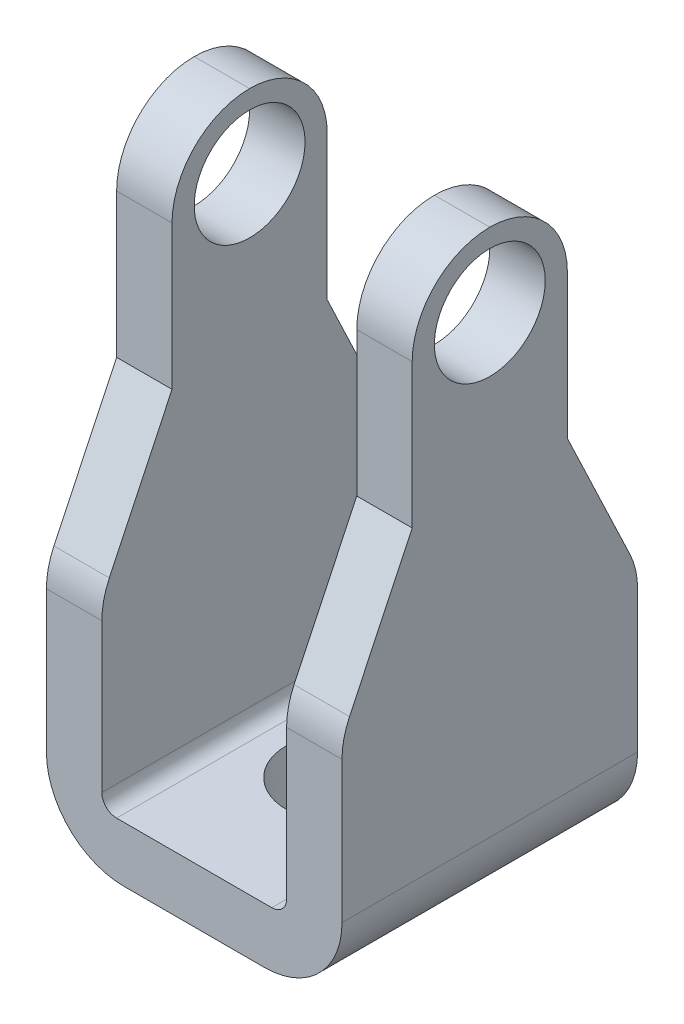
ISO-10303-21;
HEADER;
FILE_DESCRIPTION(('STEP AP214'),'2;1');
FILE_NAME('part.step','',(''),(''),'','','');
FILE_SCHEMA(('AUTOMOTIVE_DESIGN { 1 0 10303 214 1 1 1 1 }'));
ENDSEC;
DATA;
#1=APPLICATION_CONTEXT('core data for automotive mechanical design processes');
#2=APPLICATION_PROTOCOL_DEFINITION('international standard','automotive_design',2000,#1);
#3=PRODUCT_CONTEXT('',#1,'mechanical');
#4=PRODUCT('Part','Part','',(#3));
#5=PRODUCT_RELATED_PRODUCT_CATEGORY('part','',(#4));
#6=PRODUCT_DEFINITION_FORMATION('','',#4);
#7=PRODUCT_DEFINITION_CONTEXT('part definition',#1,'design');
#8=PRODUCT_DEFINITION('design','',#6,#7);
#9=PRODUCT_DEFINITION_SHAPE('','',#8);
#10=(LENGTH_UNIT() NAMED_UNIT(*) SI_UNIT(.MILLI.,.METRE.));
#11=(NAMED_UNIT(*) PLANE_ANGLE_UNIT() SI_UNIT($,.RADIAN.));
#12=(NAMED_UNIT(*) SI_UNIT($,.STERADIAN.) SOLID_ANGLE_UNIT());
#13=UNCERTAINTY_MEASURE_WITH_UNIT(LENGTH_MEASURE(1.E-05),#10,'distance_accuracy_value','');
#14=(GEOMETRIC_REPRESENTATION_CONTEXT(3) GLOBAL_UNCERTAINTY_ASSIGNED_CONTEXT((#13)) GLOBAL_UNIT_ASSIGNED_CONTEXT((#10,
#11,#12)) REPRESENTATION_CONTEXT('',''));
#15=CARTESIAN_POINT('',(0.,0.,0.));
#16=DIRECTION('',(0.,0.,1.));
#17=DIRECTION('',(1.,0.,0.));
#18=AXIS2_PLACEMENT_3D('',#15,#16,#17);
#19=CARTESIAN_POINT('',(-7.43442150862149,-4.27505183554704,-10.16));
#20=DIRECTION('',(-1.,0.,0.));
#21=DIRECTION('',(0.,0.,1.));
#22=AXIS2_PLACEMENT_3D('',#19,#20,#21);
#23=PLANE('',#22);
#24=CARTESIAN_POINT('',(-7.43442150862149,14.012948164453,-5.08));
#25=DIRECTION('',(1.,0.,0.));
#26=DIRECTION('',(0.,0.,-1.));
#27=AXIS2_PLACEMENT_3D('',#24,#25,#26);
#28=CIRCLE('',#27,1.905);
#29=CARTESIAN_POINT('',(-7.43442150862149,14.012948164453,-6.985));
#30=VERTEX_POINT('',#29);
#31=EDGE_CURVE('E580',#30,#30,#28,.T.);
#32=ORIENTED_EDGE('',*,*,#31,.T.);
#33=EDGE_LOOP('',(#32));
#34=FACE_BOUND('',#33,.T.);
#35=DIRECTION('',(0.,-1.,0.));
#36=VECTOR('',#35,1.);
#37=CARTESIAN_POINT('',(-7.43442150862149,-4.27505183554704,-10.16));
#38=LINE('',#37,#36);
#39=CARTESIAN_POINT('',(-7.43442150862149,3.25172499976167,-10.16));
#40=VERTEX_POINT('',#39);
#41=CARTESIAN_POINT('',(-7.43442150862149,-1.60805183554704,-10.16));
#42=VERTEX_POINT('',#41);
#43=EDGE_CURVE('E273',#40,#42,#38,.T.);
#44=ORIENTED_EDGE('',*,*,#43,.T.);
#45=DIRECTION('',(0.,0.,1.));
#46=VECTOR('',#45,1.);
#47=CARTESIAN_POINT('',(-7.43442150862149,-1.60805183554704,-10.16));
#48=LINE('',#47,#46);
#49=CARTESIAN_POINT('',(-7.43442150862149,-1.60805183554704,0.));
#50=VERTEX_POINT('',#49);
#51=EDGE_CURVE('E387',#42,#50,#48,.T.);
#52=ORIENTED_EDGE('',*,*,#51,.T.);
#53=DIRECTION('',(0.,-1.,0.));
#54=VECTOR('',#53,1.);
#55=CARTESIAN_POINT('',(-7.43442150862149,-4.27505183554704,0.));
#56=LINE('',#55,#54);
#57=CARTESIAN_POINT('',(-7.43442150862149,3.25172499976167,0.));
#58=VERTEX_POINT('',#57);
#59=EDGE_CURVE('E272',#58,#50,#56,.T.);
#60=ORIENTED_EDGE('',*,*,#59,.F.);
#61=CARTESIAN_POINT('',(-7.43442150862149,3.25172499976167,-2.667));
#62=DIRECTION('',(-1.,0.,0.));
#63=DIRECTION('',(0.,0.,1.));
#64=AXIS2_PLACEMENT_3D('',#61,#62,#63);
#65=CIRCLE('',#64,2.667);
#66=CARTESIAN_POINT('',(-7.43442150862149,4.39601952421529,-0.257958895887109));
#67=VERTEX_POINT('',#66);
#68=EDGE_CURVE('E212',#58,#67,#65,.T.);
#69=ORIENTED_EDGE('',*,*,#68,.T.);
#70=DIRECTION('',(0.,0.90327750435429,-0.429056814568288));
#71=VECTOR('',#70,1.);
#72=CARTESIAN_POINT('',(-7.43442150862149,8.93294816445296,-2.413));
#73=LINE('',#72,#71);
#74=CARTESIAN_POINT('',(-7.43442150862149,8.93294816445296,-2.413));
#75=VERTEX_POINT('',#74);
#76=EDGE_CURVE('E204',#67,#75,#73,.T.);
#77=ORIENTED_EDGE('',*,*,#76,.T.);
#78=DIRECTION('',(0.,1.,0.));
#79=VECTOR('',#78,1.);
#80=CARTESIAN_POINT('',(-7.43442150862149,16.552948164453,-2.413));
#81=LINE('',#80,#79);
#82=CARTESIAN_POINT('',(-7.43442150862149,13.885948164453,-2.413));
#83=VERTEX_POINT('',#82);
#84=EDGE_CURVE('E208',#75,#83,#81,.T.);
#85=ORIENTED_EDGE('',*,*,#84,.T.);
#86=CARTESIAN_POINT('',(-7.43442150862149,13.885948164453,-5.08));
#87=DIRECTION('',(-1.,0.,0.));
#88=DIRECTION('',(0.,0.,1.));
#89=AXIS2_PLACEMENT_3D('',#86,#87,#88);
#90=CIRCLE('',#89,2.667);
#91=CARTESIAN_POINT('',(-7.43442150862149,16.552948164453,-5.08));
#92=VERTEX_POINT('',#91);
#93=EDGE_CURVE('E322',#83,#92,#90,.T.);
#94=ORIENTED_EDGE('',*,*,#93,.T.);
#95=CARTESIAN_POINT('',(-7.43442150862149,13.885948164453,-5.08));
#96=DIRECTION('',(-1.,0.,0.));
#97=DIRECTION('',(0.,0.,1.));
#98=AXIS2_PLACEMENT_3D('',#95,#96,#97);
#99=CIRCLE('',#98,2.667);
#100=CARTESIAN_POINT('',(-7.43442150862149,13.885948164453,-7.747));
#101=VERTEX_POINT('',#100);
#102=EDGE_CURVE('E324',#92,#101,#99,.T.);
#103=ORIENTED_EDGE('',*,*,#102,.T.);
#104=DIRECTION('',(0.,-1.,0.));
#105=VECTOR('',#104,1.);
#106=CARTESIAN_POINT('',(-7.43442150862149,16.552948164453,-7.747));
#107=LINE('',#106,#105);
#108=CARTESIAN_POINT('',(-7.43442150862149,8.93294816445296,-7.747));
#109=VERTEX_POINT('',#108);
#110=EDGE_CURVE('E241',#101,#109,#107,.T.);
#111=ORIENTED_EDGE('',*,*,#110,.T.);
#112=DIRECTION('',(0.,-0.90327750435429,-0.429056814568288));
#113=VECTOR('',#112,1.);
#114=CARTESIAN_POINT('',(-7.43442150862149,8.93294816445296,-7.747));
#115=LINE('',#114,#113);
#116=CARTESIAN_POINT('',(-7.43442150862149,4.3960195242153,-9.90204110411289));
#117=VERTEX_POINT('',#116);
#118=EDGE_CURVE('E243',#109,#117,#115,.T.);
#119=ORIENTED_EDGE('',*,*,#118,.T.);
#120=CARTESIAN_POINT('',(-7.43442150862149,3.25172499976167,-7.493));
#121=DIRECTION('',(-1.,0.,0.));
#122=DIRECTION('',(0.,0.,1.));
#123=AXIS2_PLACEMENT_3D('',#120,#121,#122);
#124=CIRCLE('',#123,2.667);
#125=EDGE_CURVE('E361',#117,#40,#124,.T.);
#126=ORIENTED_EDGE('',*,*,#125,.T.);
#127=EDGE_LOOP('',(#44,#52,#60,#69,#77,#85,#94,#103,#111,#119,#126));
#128=FACE_BOUND('',#127,.T.);
#129=ADVANCED_FACE('F33',(#34,#128),#23,.T.);
#130=CARTESIAN_POINT('',(-5.52942150862149,16.552948164453,-10.16));
#131=DIRECTION('',(1.,0.,0.));
#132=DIRECTION('',(0.,1.,0.));
#133=AXIS2_PLACEMENT_3D('',#130,#131,#132);
#134=PLANE('',#133);
#135=CARTESIAN_POINT('',(-5.52942150862149,14.012948164453,-5.08));
#136=DIRECTION('',(1.,0.,0.));
#137=DIRECTION('',(0.,1.,0.));
#138=AXIS2_PLACEMENT_3D('',#135,#136,#137);
#139=CIRCLE('',#138,1.905);
#140=CARTESIAN_POINT('',(-5.52942150862149,15.917948164453,-5.08));
#141=VERTEX_POINT('',#140);
#142=EDGE_CURVE('E250',#141,#141,#139,.T.);
#143=ORIENTED_EDGE('',*,*,#142,.F.);
#144=EDGE_LOOP('',(#143));
#145=FACE_BOUND('',#144,.T.);
#146=DIRECTION('',(0.,1.,0.));
#147=VECTOR('',#146,1.);
#148=CARTESIAN_POINT('',(-5.52942150862149,16.552948164453,0.));
#149=LINE('',#148,#147);
#150=CARTESIAN_POINT('',(-5.52942150862149,-1.86205183554704,0.));
#151=VERTEX_POINT('',#150);
#152=CARTESIAN_POINT('',(-5.52942150862149,3.25172499976167,0.));
#153=VERTEX_POINT('',#152);
#154=EDGE_CURVE('E276',#151,#153,#149,.T.);
#155=ORIENTED_EDGE('',*,*,#154,.F.);
#156=DIRECTION('',(0.,0.,1.));
#157=VECTOR('',#156,1.);
#158=CARTESIAN_POINT('',(-5.52942150862149,-1.86205183554704,-10.16));
#159=LINE('',#158,#157);
#160=CARTESIAN_POINT('',(-5.52942150862149,-1.86205183554704,-10.16));
#161=VERTEX_POINT('',#160);
#162=EDGE_CURVE('E54',#151,#161,#159,.F.);
#163=ORIENTED_EDGE('',*,*,#162,.T.);
#164=DIRECTION('',(0.,1.,0.));
#165=VECTOR('',#164,1.);
#166=CARTESIAN_POINT('',(-5.52942150862149,16.552948164453,-10.16));
#167=LINE('',#166,#165);
#168=CARTESIAN_POINT('',(-5.52942150862149,3.25172499976167,-10.16));
#169=VERTEX_POINT('',#168);
#170=EDGE_CURVE('E287',#161,#169,#167,.T.);
#171=ORIENTED_EDGE('',*,*,#170,.T.);
#172=CARTESIAN_POINT('',(-5.52942150862149,3.25172499976167,-7.493));
#173=DIRECTION('',(1.,0.,0.));
#174=DIRECTION('',(0.,1.,0.));
#175=AXIS2_PLACEMENT_3D('',#172,#173,#174);
#176=CIRCLE('',#175,2.667);
#177=CARTESIAN_POINT('',(-5.52942150862149,4.3960195242153,-9.90204110411289));
#178=VERTEX_POINT('',#177);
#179=EDGE_CURVE('E356',#169,#178,#176,.T.);
#180=ORIENTED_EDGE('',*,*,#179,.T.);
#181=DIRECTION('',(0.,-0.90327750435429,-0.429056814568288));
#182=VECTOR('',#181,1.);
#183=CARTESIAN_POINT('',(-5.52942150862149,14.2150083378339,-5.23802141764406));
#184=LINE('',#183,#182);
#185=CARTESIAN_POINT('',(-5.52942150862149,8.93294816445296,-7.747));
#186=VERTEX_POINT('',#185);
#187=EDGE_CURVE('E260',#186,#178,#184,.T.);
#188=ORIENTED_EDGE('',*,*,#187,.F.);
#189=DIRECTION('',(0.,-1.,0.));
#190=VECTOR('',#189,1.);
#191=CARTESIAN_POINT('',(-5.52942150862149,16.552948164453,-7.747));
#192=LINE('',#191,#190);
#193=CARTESIAN_POINT('',(-5.52942150862149,13.885948164453,-7.747));
#194=VERTEX_POINT('',#193);
#195=EDGE_CURVE('E266',#194,#186,#192,.T.);
#196=ORIENTED_EDGE('',*,*,#195,.F.);
#197=CARTESIAN_POINT('',(-5.52942150862149,13.885948164453,-5.08));
#198=DIRECTION('',(1.,0.,0.));
#199=DIRECTION('',(0.,1.,0.));
#200=AXIS2_PLACEMENT_3D('',#197,#198,#199);
#201=CIRCLE('',#200,2.667);
#202=CARTESIAN_POINT('',(-5.52942150862149,16.552948164453,-5.08));
#203=VERTEX_POINT('',#202);
#204=EDGE_CURVE('E320',#194,#203,#201,.T.);
#205=ORIENTED_EDGE('',*,*,#204,.T.);
#206=CARTESIAN_POINT('',(-5.52942150862149,13.885948164453,-5.08));
#207=DIRECTION('',(1.,0.,0.));
#208=DIRECTION('',(0.,1.,0.));
#209=AXIS2_PLACEMENT_3D('',#206,#207,#208);
#210=CIRCLE('',#209,2.667);
#211=CARTESIAN_POINT('',(-5.52942150862149,13.885948164453,-2.413));
#212=VERTEX_POINT('',#211);
#213=EDGE_CURVE('E318',#203,#212,#210,.T.);
#214=ORIENTED_EDGE('',*,*,#213,.T.);
#215=DIRECTION('',(0.,1.,0.));
#216=VECTOR('',#215,1.);
#217=CARTESIAN_POINT('',(-5.52942150862149,16.552948164453,-2.413));
#218=LINE('',#217,#216);
#219=CARTESIAN_POINT('',(-5.52942150862149,8.93294816445296,-2.413));
#220=VERTEX_POINT('',#219);
#221=EDGE_CURVE('E270',#220,#212,#218,.T.);
#222=ORIENTED_EDGE('',*,*,#221,.F.);
#223=DIRECTION('',(0.,0.90327750435429,-0.429056814568288));
#224=VECTOR('',#223,1.);
#225=CARTESIAN_POINT('',(-5.52942150862149,18.1525912037186,-6.7923304436512));
#226=LINE('',#225,#224);
#227=CARTESIAN_POINT('',(-5.52942150862149,4.3960195242153,-0.257958895887109));
#228=VERTEX_POINT('',#227);
#229=EDGE_CURVE('E222',#228,#220,#226,.T.);
#230=ORIENTED_EDGE('',*,*,#229,.F.);
#231=CARTESIAN_POINT('',(-5.52942150862149,3.25172499976167,-2.667));
#232=DIRECTION('',(1.,0.,0.));
#233=DIRECTION('',(0.,1.,0.));
#234=AXIS2_PLACEMENT_3D('',#231,#232,#233);
#235=CIRCLE('',#234,2.667);
#236=EDGE_CURVE('E353',#228,#153,#235,.T.);
#237=ORIENTED_EDGE('',*,*,#236,.T.);
#238=EDGE_LOOP('',(#155,#163,#171,#180,#188,#196,#205,#214,#222,#230,#237));
#239=FACE_BOUND('',#238,.T.);
#240=ADVANCED_FACE('F427',(#145,#239),#134,.T.);
#241=CARTESIAN_POINT('',(-5.52942150862149,-2.37005183554704,-10.16));
#242=DIRECTION('',(0.,1.,0.));
#243=DIRECTION('',(0.,0.,1.));
#244=AXIS2_PLACEMENT_3D('',#241,#242,#243);
#245=PLANE('',#244);
#246=CARTESIAN_POINT('',(-2.35442150862149,-2.37005183554704,-5.08));
#247=DIRECTION('',(0.,1.,0.));
#248=DIRECTION('',(0.,0.,1.));
#249=AXIS2_PLACEMENT_3D('',#246,#247,#248);
#250=CIRCLE('',#249,1.905);
#251=CARTESIAN_POINT('',(-2.35442150862149,-2.37005183554704,-3.175));
#252=VERTEX_POINT('',#251);
#253=EDGE_CURVE('E335',#252,#252,#250,.T.);
#254=ORIENTED_EDGE('',*,*,#253,.F.);
#255=EDGE_LOOP('',(#254));
#256=FACE_BOUND('',#255,.T.);
#257=DIRECTION('',(-1.,0.,0.));
#258=VECTOR('',#257,1.);
#259=CARTESIAN_POINT('',(-5.52942150862149,-2.37005183554704,0.));
#260=LINE('',#259,#258);
#261=CARTESIAN_POINT('',(0.312578491378513,-2.37005183554704,0.));
#262=VERTEX_POINT('',#261);
#263=CARTESIAN_POINT('',(-5.02142150862149,-2.37005183554704,0.));
#264=VERTEX_POINT('',#263);
#265=EDGE_CURVE('E300',#262,#264,#260,.T.);
#266=ORIENTED_EDGE('',*,*,#265,.F.);
#267=DIRECTION('',(0.,0.,1.));
#268=VECTOR('',#267,1.);
#269=CARTESIAN_POINT('',(0.312578491378512,-2.37005183554704,-10.16));
#270=LINE('',#269,#268);
#271=CARTESIAN_POINT('',(0.312578491378513,-2.37005183554704,-10.16));
#272=VERTEX_POINT('',#271);
#273=EDGE_CURVE('E396',#262,#272,#270,.F.);
#274=ORIENTED_EDGE('',*,*,#273,.T.);
#275=DIRECTION('',(-1.,0.,0.));
#276=VECTOR('',#275,1.);
#277=CARTESIAN_POINT('',(-5.52942150862149,-2.37005183554704,-10.16));
#278=LINE('',#277,#276);
#279=CARTESIAN_POINT('',(-5.02142150862149,-2.37005183554704,-10.16));
#280=VERTEX_POINT('',#279);
#281=EDGE_CURVE('E284',#272,#280,#278,.T.);
#282=ORIENTED_EDGE('',*,*,#281,.T.);
#283=DIRECTION('',(0.,0.,1.));
#284=VECTOR('',#283,1.);
#285=CARTESIAN_POINT('',(-5.02142150862149,-2.37005183554704,0.));
#286=LINE('',#285,#284);
#287=EDGE_CURVE('E393',#280,#264,#286,.T.);
#288=ORIENTED_EDGE('',*,*,#287,.T.);
#289=EDGE_LOOP('',(#266,#274,#282,#288));
#290=FACE_BOUND('',#289,.T.);
#291=ADVANCED_FACE('F420',(#256,#290),#245,.T.);
#292=CARTESIAN_POINT('',(0.820578491378512,-2.37005183554704,-10.16));
#293=DIRECTION('',(-1.,0.,0.));
#294=DIRECTION('',(0.,0.,1.));
#295=AXIS2_PLACEMENT_3D('',#292,#293,#294);
#296=PLANE('',#295);
#297=CARTESIAN_POINT('',(0.820578491378513,14.012948164453,-5.08));
#298=DIRECTION('',(-1.,0.,0.));
#299=DIRECTION('',(0.,0.,1.));
#300=AXIS2_PLACEMENT_3D('',#297,#298,#299);
#301=CIRCLE('',#300,1.905);
#302=CARTESIAN_POINT('',(0.820578491378513,14.012948164453,-3.175));
#303=VERTEX_POINT('',#302);
#304=EDGE_CURVE('E582',#303,#303,#301,.T.);
#305=ORIENTED_EDGE('',*,*,#304,.F.);
#306=EDGE_LOOP('',(#305));
#307=FACE_BOUND('',#306,.T.);
#308=DIRECTION('',(0.,-1.,0.));
#309=VECTOR('',#308,1.);
#310=CARTESIAN_POINT('',(0.820578491378512,-2.37005183554704,-10.16));
#311=LINE('',#310,#309);
#312=CARTESIAN_POINT('',(0.820578491378512,3.25172499976167,-10.16));
#313=VERTEX_POINT('',#312);
#314=CARTESIAN_POINT('',(0.820578491378512,-1.86205183554704,-10.16));
#315=VERTEX_POINT('',#314);
#316=EDGE_CURVE('E281',#313,#315,#311,.T.);
#317=ORIENTED_EDGE('',*,*,#316,.T.);
#318=DIRECTION('',(0.,0.,1.));
#319=VECTOR('',#318,1.);
#320=CARTESIAN_POINT('',(0.820578491378512,-1.86205183554704,0.));
#321=LINE('',#320,#319);
#322=CARTESIAN_POINT('',(0.820578491378512,-1.86205183554704,0.));
#323=VERTEX_POINT('',#322);
#324=EDGE_CURVE('E390',#315,#323,#321,.T.);
#325=ORIENTED_EDGE('',*,*,#324,.T.);
#326=DIRECTION('',(0.,-1.,0.));
#327=VECTOR('',#326,1.);
#328=CARTESIAN_POINT('',(0.820578491378512,-2.37005183554704,0.));
#329=LINE('',#328,#327);
#330=CARTESIAN_POINT('',(0.820578491378512,3.25172499976167,0.));
#331=VERTEX_POINT('',#330);
#332=EDGE_CURVE('E297',#331,#323,#329,.T.);
#333=ORIENTED_EDGE('',*,*,#332,.F.);
#334=CARTESIAN_POINT('',(0.820578491378512,3.25172499976167,-2.667));
#335=DIRECTION('',(-1.,0.,0.));
#336=DIRECTION('',(0.,0.,1.));
#337=AXIS2_PLACEMENT_3D('',#334,#335,#336);
#338=CIRCLE('',#337,2.667);
#339=CARTESIAN_POINT('',(0.820578491378512,4.3960195242153,-0.257958895887108));
#340=VERTEX_POINT('',#339);
#341=EDGE_CURVE('E338',#331,#340,#338,.T.);
#342=ORIENTED_EDGE('',*,*,#341,.T.);
#343=DIRECTION('',(0.,-0.90327750435429,0.429056814568288));
#344=VECTOR('',#343,1.);
#345=CARTESIAN_POINT('',(0.820578491378512,2.71312154538106,0.541417644059152));
#346=LINE('',#345,#344);
#347=CARTESIAN_POINT('',(0.820578491378513,8.93294816445296,-2.413));
#348=VERTEX_POINT('',#347);
#349=EDGE_CURVE('E226',#348,#340,#346,.T.);
#350=ORIENTED_EDGE('',*,*,#349,.F.);
#351=DIRECTION('',(0.,-1.,0.));
#352=VECTOR('',#351,1.);
#353=CARTESIAN_POINT('',(0.820578491378512,-2.37005183554704,-2.41300000000001));
#354=LINE('',#353,#352);
#355=CARTESIAN_POINT('',(0.820578491378512,13.885948164453,-2.413));
#356=VERTEX_POINT('',#355);
#357=EDGE_CURVE('E268',#356,#348,#354,.T.);
#358=ORIENTED_EDGE('',*,*,#357,.F.);
#359=CARTESIAN_POINT('',(0.820578491378512,13.885948164453,-5.08));
#360=DIRECTION('',(-1.,0.,0.));
#361=DIRECTION('',(0.,0.,1.));
#362=AXIS2_PLACEMENT_3D('',#359,#360,#361);
#363=CIRCLE('',#362,2.667);
#364=CARTESIAN_POINT('',(0.820578491378512,16.552948164453,-5.08));
#365=VERTEX_POINT('',#364);
#366=EDGE_CURVE('E311',#356,#365,#363,.T.);
#367=ORIENTED_EDGE('',*,*,#366,.T.);
#368=CARTESIAN_POINT('',(0.820578491378513,13.885948164453,-5.08));
#369=DIRECTION('',(-1.,0.,0.));
#370=DIRECTION('',(0.,0.,1.));
#371=AXIS2_PLACEMENT_3D('',#368,#369,#370);
#372=CIRCLE('',#371,2.667);
#373=CARTESIAN_POINT('',(0.820578491378512,13.885948164453,-7.747));
#374=VERTEX_POINT('',#373);
#375=EDGE_CURVE('E309',#365,#374,#372,.T.);
#376=ORIENTED_EDGE('',*,*,#375,.T.);
#377=DIRECTION('',(0.,1.,0.));
#378=VECTOR('',#377,1.);
#379=CARTESIAN_POINT('',(0.820578491378512,-2.37005183554704,-7.747));
#380=LINE('',#379,#378);
#381=CARTESIAN_POINT('',(0.820578491378513,8.93294816445296,-7.747));
#382=VERTEX_POINT('',#381);
#383=EDGE_CURVE('E263',#382,#374,#380,.T.);
#384=ORIENTED_EDGE('',*,*,#383,.F.);
#385=DIRECTION('',(0.,0.90327750435429,0.429056814568288));
#386=VECTOR('',#385,1.);
#387=CARTESIAN_POINT('',(0.820578491378512,-1.22446132050369,-12.5717695053544));
#388=LINE('',#387,#386);
#389=CARTESIAN_POINT('',(0.820578491378512,4.3960195242153,-9.90204110411289));
#390=VERTEX_POINT('',#389);
#391=EDGE_CURVE('E258',#390,#382,#388,.T.);
#392=ORIENTED_EDGE('',*,*,#391,.F.);
#393=CARTESIAN_POINT('',(0.820578491378513,3.25172499976167,-7.493));
#394=DIRECTION('',(-1.,0.,0.));
#395=DIRECTION('',(0.,0.,1.));
#396=AXIS2_PLACEMENT_3D('',#393,#394,#395);
#397=CIRCLE('',#396,2.667);
#398=EDGE_CURVE('E340',#390,#313,#397,.T.);
#399=ORIENTED_EDGE('',*,*,#398,.T.);
#400=EDGE_LOOP('',(#317,#325,#333,#342,#350,#358,#367,#376,#384,#392,#399));
#401=FACE_BOUND('',#400,.T.);
#402=ADVANCED_FACE('F413',(#307,#401),#296,.T.);
#403=CARTESIAN_POINT('',(2.72557849137851,-4.27505183554704,-10.16));
#404=DIRECTION('',(1.,0.,0.));
#405=DIRECTION('',(0.,0.,-1.));
#406=AXIS2_PLACEMENT_3D('',#403,#404,#405);
#407=PLANE('',#406);
#408=CARTESIAN_POINT('',(2.72557849137851,14.012948164453,-5.08));
#409=DIRECTION('',(1.,0.,0.));
#410=DIRECTION('',(0.,0.,-1.));
#411=AXIS2_PLACEMENT_3D('',#408,#409,#410);
#412=CIRCLE('',#411,1.905);
#413=CARTESIAN_POINT('',(2.72557849137851,14.012948164453,-6.985));
#414=VERTEX_POINT('',#413);
#415=EDGE_CURVE('E331',#414,#414,#412,.T.);
#416=ORIENTED_EDGE('',*,*,#415,.F.);
#417=EDGE_LOOP('',(#416));
#418=FACE_BOUND('',#417,.T.);
#419=DIRECTION('',(0.,1.,0.));
#420=VECTOR('',#419,1.);
#421=CARTESIAN_POINT('',(2.72557849137851,-4.27505183554704,0.));
#422=LINE('',#421,#420);
#423=CARTESIAN_POINT('',(2.72557849137851,-1.60805183554704,0.));
#424=VERTEX_POINT('',#423);
#425=CARTESIAN_POINT('',(2.72557849137851,3.25172499976167,0.));
#426=VERTEX_POINT('',#425);
#427=EDGE_CURVE('E295',#424,#426,#422,.T.);
#428=ORIENTED_EDGE('',*,*,#427,.F.);
#429=DIRECTION('',(0.,0.,1.));
#430=VECTOR('',#429,1.);
#431=CARTESIAN_POINT('',(2.72557849137851,-1.60805183554704,-10.16));
#432=LINE('',#431,#430);
#433=CARTESIAN_POINT('',(2.72557849137851,-1.60805183554704,-10.16));
#434=VERTEX_POINT('',#433);
#435=EDGE_CURVE('E381',#424,#434,#432,.F.);
#436=ORIENTED_EDGE('',*,*,#435,.T.);
#437=DIRECTION('',(0.,1.,0.));
#438=VECTOR('',#437,1.);
#439=CARTESIAN_POINT('',(2.72557849137851,-4.27505183554704,-10.16));
#440=LINE('',#439,#438);
#441=CARTESIAN_POINT('',(2.72557849137851,3.25172499976167,-10.16));
#442=VERTEX_POINT('',#441);
#443=EDGE_CURVE('E279',#434,#442,#440,.T.);
#444=ORIENTED_EDGE('',*,*,#443,.T.);
#445=CARTESIAN_POINT('',(2.72557849137851,3.25172499976167,-7.493));
#446=DIRECTION('',(1.,0.,0.));
#447=DIRECTION('',(0.,0.,-1.));
#448=AXIS2_PLACEMENT_3D('',#445,#446,#447);
#449=CIRCLE('',#448,2.667);
#450=CARTESIAN_POINT('',(2.72557849137851,4.3960195242153,-9.90204110411289));
#451=VERTEX_POINT('',#450);
#452=EDGE_CURVE('E351',#442,#451,#449,.T.);
#453=ORIENTED_EDGE('',*,*,#452,.T.);
#454=DIRECTION('',(0.,-0.90327750435429,-0.429056814568288));
#455=VECTOR('',#454,1.);
#456=CARTESIAN_POINT('',(2.72557849137851,8.93294816445296,-7.747));
#457=LINE('',#456,#455);
#458=CARTESIAN_POINT('',(2.72557849137851,8.93294816445296,-7.747));
#459=VERTEX_POINT('',#458);
#460=EDGE_CURVE('E244',#459,#451,#457,.T.);
#461=ORIENTED_EDGE('',*,*,#460,.F.);
#462=DIRECTION('',(0.,-1.,0.));
#463=VECTOR('',#462,1.);
#464=CARTESIAN_POINT('',(2.72557849137851,16.552948164453,-7.747));
#465=LINE('',#464,#463);
#466=CARTESIAN_POINT('',(2.72557849137851,13.885948164453,-7.747));
#467=VERTEX_POINT('',#466);
#468=EDGE_CURVE('E248',#467,#459,#465,.T.);
#469=ORIENTED_EDGE('',*,*,#468,.F.);
#470=CARTESIAN_POINT('',(2.72557849137851,13.885948164453,-5.08));
#471=DIRECTION('',(1.,0.,0.));
#472=DIRECTION('',(0.,0.,-1.));
#473=AXIS2_PLACEMENT_3D('',#470,#471,#472);
#474=CIRCLE('',#473,2.667);
#475=CARTESIAN_POINT('',(2.72557849137851,16.552948164453,-5.08));
#476=VERTEX_POINT('',#475);
#477=EDGE_CURVE('E289',#467,#476,#474,.T.);
#478=ORIENTED_EDGE('',*,*,#477,.T.);
#479=CARTESIAN_POINT('',(2.72557849137851,13.885948164453,-5.08));
#480=DIRECTION('',(1.,0.,0.));
#481=DIRECTION('',(0.,0.,-1.));
#482=AXIS2_PLACEMENT_3D('',#479,#480,#481);
#483=CIRCLE('',#482,2.667);
#484=CARTESIAN_POINT('',(2.72557849137851,13.885948164453,-2.413));
#485=VERTEX_POINT('',#484);
#486=EDGE_CURVE('E304',#476,#485,#483,.T.);
#487=ORIENTED_EDGE('',*,*,#486,.T.);
#488=DIRECTION('',(0.,1.,0.));
#489=VECTOR('',#488,1.);
#490=CARTESIAN_POINT('',(2.72557849137851,16.552948164453,-2.413));
#491=LINE('',#490,#489);
#492=CARTESIAN_POINT('',(2.72557849137851,8.93294816445296,-2.413));
#493=VERTEX_POINT('',#492);
#494=EDGE_CURVE('E216',#493,#485,#491,.T.);
#495=ORIENTED_EDGE('',*,*,#494,.F.);
#496=DIRECTION('',(0.,0.90327750435429,-0.429056814568288));
#497=VECTOR('',#496,1.);
#498=CARTESIAN_POINT('',(2.72557849137851,8.93294816445296,-2.413));
#499=LINE('',#498,#497);
#500=CARTESIAN_POINT('',(2.72557849137851,4.39601952421529,-0.257958895887109));
#501=VERTEX_POINT('',#500);
#502=EDGE_CURVE('E236',#501,#493,#499,.T.);
#503=ORIENTED_EDGE('',*,*,#502,.F.);
#504=CARTESIAN_POINT('',(2.72557849137851,3.25172499976167,-2.667));
#505=DIRECTION('',(1.,0.,0.));
#506=DIRECTION('',(0.,0.,-1.));
#507=AXIS2_PLACEMENT_3D('',#504,#505,#506);
#508=CIRCLE('',#507,2.667);
#509=EDGE_CURVE('E348',#501,#426,#508,.T.);
#510=ORIENTED_EDGE('',*,*,#509,.T.);
#511=EDGE_LOOP('',(#428,#436,#444,#453,#461,#469,#478,#487,#495,#503,#510));
#512=FACE_BOUND('',#511,.T.);
#513=ADVANCED_FACE('F499',(#418,#512),#407,.T.);
#514=CARTESIAN_POINT('',(-7.43442150862149,-4.27505183554704,-10.16));
#515=DIRECTION('',(0.,-1.,0.));
#516=DIRECTION('',(0.,0.,-1.));
#517=AXIS2_PLACEMENT_3D('',#514,#515,#516);
#518=PLANE('',#517);
#519=CARTESIAN_POINT('',(-2.35442150862149,-4.27505183554704,-5.08));
#520=DIRECTION('',(0.,-1.,0.));
#521=DIRECTION('',(0.,0.,-1.));
#522=AXIS2_PLACEMENT_3D('',#519,#520,#521);
#523=CIRCLE('',#522,1.905);
#524=CARTESIAN_POINT('',(-2.35442150862149,-4.27505183554704,-6.985));
#525=VERTEX_POINT('',#524);
#526=EDGE_CURVE('E593',#525,#525,#523,.T.);
#527=ORIENTED_EDGE('',*,*,#526,.F.);
#528=EDGE_LOOP('',(#527));
#529=FACE_BOUND('',#528,.T.);
#530=DIRECTION('',(1.,0.,0.));
#531=VECTOR('',#530,1.);
#532=CARTESIAN_POINT('',(-7.43442150862149,-4.27505183554704,-10.16));
#533=LINE('',#532,#531);
#534=CARTESIAN_POINT('',(-4.76742150862149,-4.27505183554704,-10.16));
#535=VERTEX_POINT('',#534);
#536=CARTESIAN_POINT('',(0.0585784913785126,-4.27505183554704,-10.16));
#537=VERTEX_POINT('',#536);
#538=EDGE_CURVE('E275',#535,#537,#533,.T.);
#539=ORIENTED_EDGE('',*,*,#538,.T.);
#540=DIRECTION('',(0.,0.,1.));
#541=VECTOR('',#540,1.);
#542=CARTESIAN_POINT('',(0.0585784913785126,-4.27505183554704,-10.16));
#543=LINE('',#542,#541);
#544=CARTESIAN_POINT('',(0.0585784913785126,-4.27505183554704,0.));
#545=VERTEX_POINT('',#544);
#546=EDGE_CURVE('E374',#537,#545,#543,.T.);
#547=ORIENTED_EDGE('',*,*,#546,.T.);
#548=DIRECTION('',(1.,0.,0.));
#549=VECTOR('',#548,1.);
#550=CARTESIAN_POINT('',(-7.43442150862149,-4.27505183554704,0.));
#551=LINE('',#550,#549);
#552=CARTESIAN_POINT('',(-4.76742150862149,-4.27505183554704,0.));
#553=VERTEX_POINT('',#552);
#554=EDGE_CURVE('E292',#553,#545,#551,.T.);
#555=ORIENTED_EDGE('',*,*,#554,.F.);
#556=DIRECTION('',(0.,0.,1.));
#557=VECTOR('',#556,1.);
#558=CARTESIAN_POINT('',(-4.76742150862149,-4.27505183554704,-10.16));
#559=LINE('',#558,#557);
#560=EDGE_CURVE('E372',#553,#535,#559,.F.);
#561=ORIENTED_EDGE('',*,*,#560,.T.);
#562=EDGE_LOOP('',(#539,#547,#555,#561));
#563=FACE_BOUND('',#562,.T.);
#564=ADVANCED_FACE('F472',(#529,#563),#518,.T.);
#565=CARTESIAN_POINT('',(0.,0.,-10.16));
#566=DIRECTION('',(0.,0.,-1.));
#567=DIRECTION('',(-1.,0.,0.));
#568=AXIS2_PLACEMENT_3D('',#565,#566,#567);
#569=PLANE('',#568);
#570=ORIENTED_EDGE('',*,*,#443,.F.);
#571=CARTESIAN_POINT('',(0.0585784913785126,-1.60805183554704,-10.16));
#572=DIRECTION('',(0.,0.,-1.));
#573=DIRECTION('',(-1.,0.,0.));
#574=AXIS2_PLACEMENT_3D('',#571,#572,#573);
#575=CIRCLE('',#574,2.667);
#576=EDGE_CURVE('E385',#434,#537,#575,.T.);
#577=ORIENTED_EDGE('',*,*,#576,.T.);
#578=ORIENTED_EDGE('',*,*,#538,.F.);
#579=CARTESIAN_POINT('',(-4.76742150862149,-1.60805183554704,-10.16));
#580=DIRECTION('',(0.,0.,-1.));
#581=DIRECTION('',(-1.,0.,0.));
#582=AXIS2_PLACEMENT_3D('',#579,#580,#581);
#583=CIRCLE('',#582,2.667);
#584=EDGE_CURVE('E383',#535,#42,#583,.T.);
#585=ORIENTED_EDGE('',*,*,#584,.T.);
#586=ORIENTED_EDGE('',*,*,#43,.F.);
#587=DIRECTION('',(1.,0.,0.));
#588=VECTOR('',#587,1.);
#589=CARTESIAN_POINT('',(-5.52942150862149,3.25172499976167,-10.16));
#590=LINE('',#589,#588);
#591=EDGE_CURVE('E342',#40,#169,#590,.T.);
#592=ORIENTED_EDGE('',*,*,#591,.T.);
#593=ORIENTED_EDGE('',*,*,#170,.F.);
#594=CARTESIAN_POINT('',(-5.02142150862149,-1.86205183554704,-10.16));
#595=DIRECTION('',(0.,0.,-1.));
#596=DIRECTION('',(-1.,0.,0.));
#597=AXIS2_PLACEMENT_3D('',#594,#595,#596);
#598=CIRCLE('',#597,0.508);
#599=EDGE_CURVE('E11',#161,#280,#598,.F.);
#600=ORIENTED_EDGE('',*,*,#599,.T.);
#601=ORIENTED_EDGE('',*,*,#281,.F.);
#602=CARTESIAN_POINT('',(0.312578491378512,-1.86205183554704,-10.16));
#603=DIRECTION('',(0.,0.,-1.));
#604=DIRECTION('',(-1.,0.,0.));
#605=AXIS2_PLACEMENT_3D('',#602,#603,#604);
#606=CIRCLE('',#605,0.508);
#607=EDGE_CURVE('E401',#272,#315,#606,.F.);
#608=ORIENTED_EDGE('',*,*,#607,.T.);
#609=ORIENTED_EDGE('',*,*,#316,.F.);
#610=DIRECTION('',(-1.,0.,0.));
#611=VECTOR('',#610,1.);
#612=CARTESIAN_POINT('',(2.72557849137851,3.25172499976167,-10.16));
#613=LINE('',#612,#611);
#614=EDGE_CURVE('E345',#313,#442,#613,.F.);
#615=ORIENTED_EDGE('',*,*,#614,.T.);
#616=EDGE_LOOP('',(#570,#577,#578,#585,#586,#592,#593,#600,#601,#608,#609,#615));
#617=FACE_BOUND('',#616,.T.);
#618=ADVANCED_FACE('F407',(#617),#569,.T.);
#619=CARTESIAN_POINT('',(0.,0.,0.));
#620=DIRECTION('',(0.,0.,-1.));
#621=DIRECTION('',(-1.,0.,0.));
#622=AXIS2_PLACEMENT_3D('',#619,#620,#621);
#623=PLANE('',#622);
#624=ORIENTED_EDGE('',*,*,#554,.T.);
#625=CARTESIAN_POINT('',(0.0585784913785126,-1.60805183554704,0.));
#626=DIRECTION('',(0.,0.,-1.));
#627=DIRECTION('',(-1.,0.,0.));
#628=AXIS2_PLACEMENT_3D('',#625,#626,#627);
#629=CIRCLE('',#628,2.667);
#630=EDGE_CURVE('E379',#545,#424,#629,.F.);
#631=ORIENTED_EDGE('',*,*,#630,.T.);
#632=ORIENTED_EDGE('',*,*,#427,.T.);
#633=DIRECTION('',(-1.,0.,0.));
#634=VECTOR('',#633,1.);
#635=CARTESIAN_POINT('',(0.,3.25172499976167,0.));
#636=LINE('',#635,#634);
#637=EDGE_CURVE('E365',#426,#331,#636,.T.);
#638=ORIENTED_EDGE('',*,*,#637,.T.);
#639=ORIENTED_EDGE('',*,*,#332,.T.);
#640=CARTESIAN_POINT('',(0.312578491378512,-1.86205183554704,0.));
#641=DIRECTION('',(0.,0.,-1.));
#642=DIRECTION('',(-1.,0.,0.));
#643=AXIS2_PLACEMENT_3D('',#640,#641,#642);
#644=CIRCLE('',#643,0.508);
#645=EDGE_CURVE('E399',#323,#262,#644,.T.);
#646=ORIENTED_EDGE('',*,*,#645,.T.);
#647=ORIENTED_EDGE('',*,*,#265,.T.);
#648=CARTESIAN_POINT('',(-5.02142150862149,-1.86205183554704,0.));
#649=DIRECTION('',(0.,0.,-1.));
#650=DIRECTION('',(-1.,0.,0.));
#651=AXIS2_PLACEMENT_3D('',#648,#649,#650);
#652=CIRCLE('',#651,0.508);
#653=EDGE_CURVE('E41',#264,#151,#652,.T.);
#654=ORIENTED_EDGE('',*,*,#653,.T.);
#655=ORIENTED_EDGE('',*,*,#154,.T.);
#656=DIRECTION('',(1.,0.,0.));
#657=VECTOR('',#656,1.);
#658=CARTESIAN_POINT('',(0.,3.25172499976167,0.));
#659=LINE('',#658,#657);
#660=EDGE_CURVE('E363',#153,#58,#659,.F.);
#661=ORIENTED_EDGE('',*,*,#660,.T.);
#662=ORIENTED_EDGE('',*,*,#59,.T.);
#663=CARTESIAN_POINT('',(-4.76742150862149,-1.60805183554704,0.));
#664=DIRECTION('',(0.,0.,-1.));
#665=DIRECTION('',(-1.,0.,0.));
#666=AXIS2_PLACEMENT_3D('',#663,#664,#665);
#667=CIRCLE('',#666,2.667);
#668=EDGE_CURVE('E377',#50,#553,#667,.F.);
#669=ORIENTED_EDGE('',*,*,#668,.T.);
#670=EDGE_LOOP('',(#624,#631,#632,#638,#639,#646,#647,#654,#655,#661,#662,#669));
#671=FACE_BOUND('',#670,.T.);
#672=ADVANCED_FACE('F418',(#671),#623,.F.);
#673=CARTESIAN_POINT('',(-7.43442150862149,8.93294816445296,-2.413));
#674=DIRECTION('',(0.,-0.429056814568288,-0.90327750435429));
#675=DIRECTION('',(0.,0.90327750435429,-0.429056814568288));
#676=AXIS2_PLACEMENT_3D('',#673,#674,#675);
#677=PLANE('',#676);
#678=ORIENTED_EDGE('',*,*,#76,.F.);
#679=DIRECTION('',(1.,0.,0.));
#680=VECTOR('',#679,1.);
#681=CARTESIAN_POINT('',(-7.43442150862149,4.39601952421529,-0.257958895887109));
#682=LINE('',#681,#680);
#683=EDGE_CURVE('E370',#67,#228,#682,.T.);
#684=ORIENTED_EDGE('',*,*,#683,.T.);
#685=ORIENTED_EDGE('',*,*,#229,.T.);
#686=DIRECTION('',(1.,0.,0.));
#687=VECTOR('',#686,1.);
#688=CARTESIAN_POINT('',(-7.43442150862149,8.93294816445296,-2.413));
#689=LINE('',#688,#687);
#690=EDGE_CURVE('E219',#75,#220,#689,.T.);
#691=ORIENTED_EDGE('',*,*,#690,.F.);
#692=EDGE_LOOP('',(#678,#684,#685,#691));
#693=FACE_BOUND('',#692,.T.);
#694=ADVANCED_FACE('F220',(#693),#677,.F.);
#695=CARTESIAN_POINT('',(-7.43442150862149,16.552948164453,-2.413));
#696=DIRECTION('',(0.,0.,-1.));
#697=DIRECTION('',(0.,1.,0.));
#698=AXIS2_PLACEMENT_3D('',#695,#696,#697);
#699=PLANE('',#698);
#700=ORIENTED_EDGE('',*,*,#221,.T.);
#701=DIRECTION('',(1.,0.,0.));
#702=VECTOR('',#701,1.);
#703=CARTESIAN_POINT('',(-7.43442150862149,13.885948164453,-2.413));
#704=LINE('',#703,#702);
#705=EDGE_CURVE('E231',#212,#83,#704,.F.);
#706=ORIENTED_EDGE('',*,*,#705,.T.);
#707=ORIENTED_EDGE('',*,*,#84,.F.);
#708=ORIENTED_EDGE('',*,*,#690,.T.);
#709=EDGE_LOOP('',(#700,#706,#707,#708));
#710=FACE_BOUND('',#709,.T.);
#711=ADVANCED_FACE('F229',(#710),#699,.F.);
#712=ORIENTED_EDGE('',*,*,#494,.T.);
#713=DIRECTION('',(1.,0.,0.));
#714=VECTOR('',#713,1.);
#715=CARTESIAN_POINT('',(0.820578491378511,13.885948164453,-2.413));
#716=LINE('',#715,#714);
#717=EDGE_CURVE('E306',#485,#356,#716,.F.);
#718=ORIENTED_EDGE('',*,*,#717,.T.);
#719=ORIENTED_EDGE('',*,*,#357,.T.);
#720=EDGE_CURVE('E227',#348,#493,#689,.T.);
#721=ORIENTED_EDGE('',*,*,#720,.T.);
#722=EDGE_LOOP('',(#712,#718,#719,#721));
#723=FACE_BOUND('',#722,.T.);
#724=ADVANCED_FACE('F550',(#723),#699,.F.);
#725=ORIENTED_EDGE('',*,*,#349,.T.);
#726=DIRECTION('',(-1.,0.,0.));
#727=VECTOR('',#726,1.);
#728=CARTESIAN_POINT('',(-7.43442150862149,4.3960195242153,-0.257958895887109));
#729=LINE('',#728,#727);
#730=EDGE_CURVE('E368',#340,#501,#729,.F.);
#731=ORIENTED_EDGE('',*,*,#730,.T.);
#732=ORIENTED_EDGE('',*,*,#502,.T.);
#733=ORIENTED_EDGE('',*,*,#720,.F.);
#734=EDGE_LOOP('',(#725,#731,#732,#733));
#735=FACE_BOUND('',#734,.T.);
#736=ADVANCED_FACE('F553',(#735),#677,.F.);
#737=CARTESIAN_POINT('',(-7.43442150862149,8.93294816445296,-7.747));
#738=DIRECTION('',(0.,-0.429056814568288,0.90327750435429));
#739=DIRECTION('',(0.,-0.90327750435429,-0.429056814568288));
#740=AXIS2_PLACEMENT_3D('',#737,#738,#739);
#741=PLANE('',#740);
#742=ORIENTED_EDGE('',*,*,#187,.T.);
#743=DIRECTION('',(1.,0.,0.));
#744=VECTOR('',#743,1.);
#745=CARTESIAN_POINT('',(-7.43442150862149,4.3960195242153,-9.90204110411289));
#746=LINE('',#745,#744);
#747=EDGE_CURVE('E358',#178,#117,#746,.F.);
#748=ORIENTED_EDGE('',*,*,#747,.T.);
#749=ORIENTED_EDGE('',*,*,#118,.F.);
#750=DIRECTION('',(1.,0.,0.));
#751=VECTOR('',#750,1.);
#752=CARTESIAN_POINT('',(-7.43442150862149,8.93294816445296,-7.747));
#753=LINE('',#752,#751);
#754=EDGE_CURVE('E238',#109,#186,#753,.T.);
#755=ORIENTED_EDGE('',*,*,#754,.T.);
#756=EDGE_LOOP('',(#742,#748,#749,#755));
#757=FACE_BOUND('',#756,.T.);
#758=ADVANCED_FACE('F435',(#757),#741,.F.);
#759=CARTESIAN_POINT('',(-7.43442150862149,16.552948164453,-7.747));
#760=DIRECTION('',(0.,0.,1.));
#761=DIRECTION('',(1.,0.,0.));
#762=AXIS2_PLACEMENT_3D('',#759,#760,#761);
#763=PLANE('',#762);
#764=ORIENTED_EDGE('',*,*,#110,.F.);
#765=DIRECTION('',(1.,0.,0.));
#766=VECTOR('',#765,1.);
#767=CARTESIAN_POINT('',(-5.52942150862149,13.885948164453,-7.747));
#768=LINE('',#767,#766);
#769=EDGE_CURVE('E315',#101,#194,#768,.T.);
#770=ORIENTED_EDGE('',*,*,#769,.T.);
#771=ORIENTED_EDGE('',*,*,#195,.T.);
#772=ORIENTED_EDGE('',*,*,#754,.F.);
#773=EDGE_LOOP('',(#764,#770,#771,#772));
#774=FACE_BOUND('',#773,.T.);
#775=ADVANCED_FACE('F441',(#774),#763,.F.);
#776=ORIENTED_EDGE('',*,*,#460,.T.);
#777=DIRECTION('',(-1.,0.,0.));
#778=VECTOR('',#777,1.);
#779=CARTESIAN_POINT('',(0.820578491378508,4.3960195242153,-9.90204110411289));
#780=LINE('',#779,#778);
#781=EDGE_CURVE('E327',#451,#390,#780,.T.);
#782=ORIENTED_EDGE('',*,*,#781,.T.);
#783=ORIENTED_EDGE('',*,*,#391,.T.);
#784=EDGE_CURVE('E247',#382,#459,#753,.T.);
#785=ORIENTED_EDGE('',*,*,#784,.T.);
#786=EDGE_LOOP('',(#776,#782,#783,#785));
#787=FACE_BOUND('',#786,.T.);
#788=ADVANCED_FACE('F503',(#787),#741,.F.);
#789=ORIENTED_EDGE('',*,*,#383,.T.);
#790=DIRECTION('',(1.,0.,0.));
#791=VECTOR('',#790,1.);
#792=CARTESIAN_POINT('',(2.72557849137851,13.885948164453,-7.747));
#793=LINE('',#792,#791);
#794=EDGE_CURVE('E313',#374,#467,#793,.T.);
#795=ORIENTED_EDGE('',*,*,#794,.T.);
#796=ORIENTED_EDGE('',*,*,#468,.T.);
#797=ORIENTED_EDGE('',*,*,#784,.F.);
#798=EDGE_LOOP('',(#789,#795,#796,#797));
#799=FACE_BOUND('',#798,.T.);
#800=ADVANCED_FACE('F492',(#799),#763,.F.);
#801=CARTESIAN_POINT('',(-7.43442150862149,14.012948164453,-5.08));
#802=DIRECTION('',(1.,0.,0.));
#803=DIRECTION('',(0.,0.,-1.));
#804=AXIS2_PLACEMENT_3D('',#801,#802,#803);
#805=CYLINDRICAL_SURFACE('',#804,1.905);
#806=ORIENTED_EDGE('',*,*,#304,.T.);
#807=EDGE_LOOP('',(#806));
#808=FACE_BOUND('',#807,.T.);
#809=ORIENTED_EDGE('',*,*,#415,.T.);
#810=EDGE_LOOP('',(#809));
#811=FACE_BOUND('',#810,.T.);
#812=ADVANCED_FACE('F483',(#808,#811),#805,.F.);
#813=ORIENTED_EDGE('',*,*,#142,.T.);
#814=EDGE_LOOP('',(#813));
#815=FACE_BOUND('',#814,.T.);
#816=ORIENTED_EDGE('',*,*,#31,.F.);
#817=EDGE_LOOP('',(#816));
#818=FACE_BOUND('',#817,.T.);
#819=ADVANCED_FACE('F478',(#815,#818),#805,.F.);
#820=CARTESIAN_POINT('',(-7.43442150862149,13.885948164453,-5.08));
#821=DIRECTION('',(-1.,0.,0.));
#822=DIRECTION('',(0.,0.,1.));
#823=AXIS2_PLACEMENT_3D('',#820,#821,#822);
#824=CYLINDRICAL_SURFACE('',#823,2.667);
#825=ORIENTED_EDGE('',*,*,#794,.F.);
#826=ORIENTED_EDGE('',*,*,#375,.F.);
#827=DIRECTION('',(1.,0.,0.));
#828=VECTOR('',#827,1.);
#829=CARTESIAN_POINT('',(0.820578491378511,16.552948164453,-5.08));
#830=LINE('',#829,#828);
#831=EDGE_CURVE('E328',#476,#365,#830,.F.);
#832=ORIENTED_EDGE('',*,*,#831,.F.);
#833=ORIENTED_EDGE('',*,*,#477,.F.);
#834=EDGE_LOOP('',(#825,#826,#832,#833));
#835=FACE_BOUND('',#834,.T.);
#836=ADVANCED_FACE('F475',(#835),#824,.T.);
#837=CARTESIAN_POINT('',(2.72557849137851,13.885948164453,-5.08));
#838=DIRECTION('',(-1.,0.,0.));
#839=DIRECTION('',(0.,0.,1.));
#840=AXIS2_PLACEMENT_3D('',#837,#838,#839);
#841=CYLINDRICAL_SURFACE('',#840,2.667);
#842=ORIENTED_EDGE('',*,*,#366,.F.);
#843=ORIENTED_EDGE('',*,*,#717,.F.);
#844=ORIENTED_EDGE('',*,*,#486,.F.);
#845=ORIENTED_EDGE('',*,*,#831,.T.);
#846=EDGE_LOOP('',(#842,#843,#844,#845));
#847=FACE_BOUND('',#846,.T.);
#848=ADVANCED_FACE('F458',(#847),#841,.T.);
#849=CARTESIAN_POINT('',(-7.43442150862149,13.885948164453,-5.08));
#850=DIRECTION('',(-1.,0.,0.));
#851=DIRECTION('',(0.,0.,1.));
#852=AXIS2_PLACEMENT_3D('',#849,#850,#851);
#853=CYLINDRICAL_SURFACE('',#852,2.667);
#854=DIRECTION('',(1.,0.,0.));
#855=VECTOR('',#854,1.);
#856=CARTESIAN_POINT('',(-5.52942150862149,16.552948164453,-5.08));
#857=LINE('',#856,#855);
#858=EDGE_CURVE('E332',#92,#203,#857,.T.);
#859=ORIENTED_EDGE('',*,*,#858,.F.);
#860=ORIENTED_EDGE('',*,*,#93,.F.);
#861=ORIENTED_EDGE('',*,*,#705,.F.);
#862=ORIENTED_EDGE('',*,*,#213,.F.);
#863=EDGE_LOOP('',(#859,#860,#861,#862));
#864=FACE_BOUND('',#863,.T.);
#865=ADVANCED_FACE('F447',(#864),#853,.T.);
#866=CARTESIAN_POINT('',(-7.43442150862149,13.885948164453,-5.08));
#867=DIRECTION('',(-1.,0.,0.));
#868=DIRECTION('',(0.,0.,1.));
#869=AXIS2_PLACEMENT_3D('',#866,#867,#868);
#870=CYLINDRICAL_SURFACE('',#869,2.667);
#871=ORIENTED_EDGE('',*,*,#102,.F.);
#872=ORIENTED_EDGE('',*,*,#858,.T.);
#873=ORIENTED_EDGE('',*,*,#204,.F.);
#874=ORIENTED_EDGE('',*,*,#769,.F.);
#875=EDGE_LOOP('',(#871,#872,#873,#874));
#876=FACE_BOUND('',#875,.T.);
#877=ADVANCED_FACE('F448',(#876),#870,.T.);
#878=CARTESIAN_POINT('',(-7.43442150862149,3.25172499976167,-7.493));
#879=DIRECTION('',(1.,0.,0.));
#880=DIRECTION('',(0.,0.,-1.));
#881=AXIS2_PLACEMENT_3D('',#878,#879,#880);
#882=CYLINDRICAL_SURFACE('',#881,2.667);
#883=ORIENTED_EDGE('',*,*,#452,.F.);
#884=ORIENTED_EDGE('',*,*,#614,.F.);
#885=ORIENTED_EDGE('',*,*,#398,.F.);
#886=ORIENTED_EDGE('',*,*,#781,.F.);
#887=EDGE_LOOP('',(#883,#884,#885,#886));
#888=FACE_BOUND('',#887,.T.);
#889=ADVANCED_FACE('F450',(#888),#882,.T.);
#890=CARTESIAN_POINT('',(0.,3.25172499976167,-7.493));
#891=DIRECTION('',(-1.,0.,0.));
#892=DIRECTION('',(0.,0.,1.));
#893=AXIS2_PLACEMENT_3D('',#890,#891,#892);
#894=CYLINDRICAL_SURFACE('',#893,2.667);
#895=ORIENTED_EDGE('',*,*,#125,.F.);
#896=ORIENTED_EDGE('',*,*,#747,.F.);
#897=ORIENTED_EDGE('',*,*,#179,.F.);
#898=ORIENTED_EDGE('',*,*,#591,.F.);
#899=EDGE_LOOP('',(#895,#896,#897,#898));
#900=FACE_BOUND('',#899,.T.);
#901=ADVANCED_FACE('F432',(#900),#894,.T.);
#902=CARTESIAN_POINT('',(0.,3.25172499976167,-2.667));
#903=DIRECTION('',(-1.,0.,0.));
#904=DIRECTION('',(0.,0.,1.));
#905=AXIS2_PLACEMENT_3D('',#902,#903,#904);
#906=CYLINDRICAL_SURFACE('',#905,2.667);
#907=ORIENTED_EDGE('',*,*,#509,.F.);
#908=ORIENTED_EDGE('',*,*,#730,.F.);
#909=ORIENTED_EDGE('',*,*,#341,.F.);
#910=ORIENTED_EDGE('',*,*,#637,.F.);
#911=EDGE_LOOP('',(#907,#908,#909,#910));
#912=FACE_BOUND('',#911,.T.);
#913=ADVANCED_FACE('F521',(#912),#906,.T.);
#914=CARTESIAN_POINT('',(-7.43442150862149,3.25172499976167,-2.667));
#915=DIRECTION('',(1.,0.,0.));
#916=DIRECTION('',(0.,0.,-1.));
#917=AXIS2_PLACEMENT_3D('',#914,#915,#916);
#918=CYLINDRICAL_SURFACE('',#917,2.667);
#919=ORIENTED_EDGE('',*,*,#68,.F.);
#920=ORIENTED_EDGE('',*,*,#660,.F.);
#921=ORIENTED_EDGE('',*,*,#236,.F.);
#922=ORIENTED_EDGE('',*,*,#683,.F.);
#923=EDGE_LOOP('',(#919,#920,#921,#922));
#924=FACE_BOUND('',#923,.T.);
#925=ADVANCED_FACE('F519',(#924),#918,.T.);
#926=CARTESIAN_POINT('',(0.0585784913785126,-1.60805183554704,-10.16));
#927=DIRECTION('',(0.,0.,1.));
#928=DIRECTION('',(1.,0.,0.));
#929=AXIS2_PLACEMENT_3D('',#926,#927,#928);
#930=CYLINDRICAL_SURFACE('',#929,2.667);
#931=ORIENTED_EDGE('',*,*,#576,.F.);
#932=ORIENTED_EDGE('',*,*,#435,.F.);
#933=ORIENTED_EDGE('',*,*,#630,.F.);
#934=ORIENTED_EDGE('',*,*,#546,.F.);
#935=EDGE_LOOP('',(#931,#932,#933,#934));
#936=FACE_BOUND('',#935,.T.);
#937=ADVANCED_FACE('F509',(#936),#930,.T.);
#938=CARTESIAN_POINT('',(-4.76742150862149,-1.60805183554704,-10.16));
#939=DIRECTION('',(0.,0.,1.));
#940=DIRECTION('',(1.,0.,0.));
#941=AXIS2_PLACEMENT_3D('',#938,#939,#940);
#942=CYLINDRICAL_SURFACE('',#941,2.667);
#943=ORIENTED_EDGE('',*,*,#584,.F.);
#944=ORIENTED_EDGE('',*,*,#560,.F.);
#945=ORIENTED_EDGE('',*,*,#668,.F.);
#946=ORIENTED_EDGE('',*,*,#51,.F.);
#947=EDGE_LOOP('',(#943,#944,#945,#946));
#948=FACE_BOUND('',#947,.T.);
#949=ADVANCED_FACE('F516',(#948),#942,.T.);
#950=CARTESIAN_POINT('',(0.312578491378512,-1.86205183554704,-10.16));
#951=DIRECTION('',(0.,0.,-1.));
#952=DIRECTION('',(-1.,0.,0.));
#953=AXIS2_PLACEMENT_3D('',#950,#951,#952);
#954=CYLINDRICAL_SURFACE('',#953,0.508);
#955=ORIENTED_EDGE('',*,*,#607,.F.);
#956=ORIENTED_EDGE('',*,*,#273,.F.);
#957=ORIENTED_EDGE('',*,*,#645,.F.);
#958=ORIENTED_EDGE('',*,*,#324,.F.);
#959=EDGE_LOOP('',(#955,#956,#957,#958));
#960=FACE_BOUND('',#959,.T.);
#961=ADVANCED_FACE('F416',(#960),#954,.F.);
#962=CARTESIAN_POINT('',(-5.02142150862149,-1.86205183554704,-10.16));
#963=DIRECTION('',(0.,0.,-1.));
#964=DIRECTION('',(-1.,0.,0.));
#965=AXIS2_PLACEMENT_3D('',#962,#963,#964);
#966=CYLINDRICAL_SURFACE('',#965,0.508);
#967=ORIENTED_EDGE('',*,*,#599,.F.);
#968=ORIENTED_EDGE('',*,*,#162,.F.);
#969=ORIENTED_EDGE('',*,*,#653,.F.);
#970=ORIENTED_EDGE('',*,*,#287,.F.);
#971=EDGE_LOOP('',(#967,#968,#969,#970));
#972=FACE_BOUND('',#971,.T.);
#973=ADVANCED_FACE('F35',(#972),#966,.F.);
#974=CARTESIAN_POINT('',(-2.35442150862149,5.88494816445296,-5.08));
#975=DIRECTION('',(0.,-1.,0.));
#976=DIRECTION('',(0.,0.,-1.));
#977=AXIS2_PLACEMENT_3D('',#974,#975,#976);
#978=CYLINDRICAL_SURFACE('',#977,1.905);
#979=ORIENTED_EDGE('',*,*,#253,.T.);
#980=EDGE_LOOP('',(#979));
#981=FACE_BOUND('',#980,.T.);
#982=ORIENTED_EDGE('',*,*,#526,.T.);
#983=EDGE_LOOP('',(#982));
#984=FACE_BOUND('',#983,.T.);
#985=ADVANCED_FACE('F537',(#981,#984),#978,.F.);
#986=CLOSED_SHELL('',(#129,#240,#291,#402,#513,#564,#618,#672,#694,#711,#724,#736,#758,#775,
#788,#800,#812,#819,#836,#848,#865,#877,#889,#901,#913,#925,#937,#949,#961,#973,#985));
#987=MANIFOLD_SOLID_BREP('B2',#986);
#988=ADVANCED_BREP_SHAPE_REPRESENTATION('',(#18,#987),#14);
#989=SHAPE_DEFINITION_REPRESENTATION(#9,#988);
ENDSEC;
END-ISO-10303-21;
